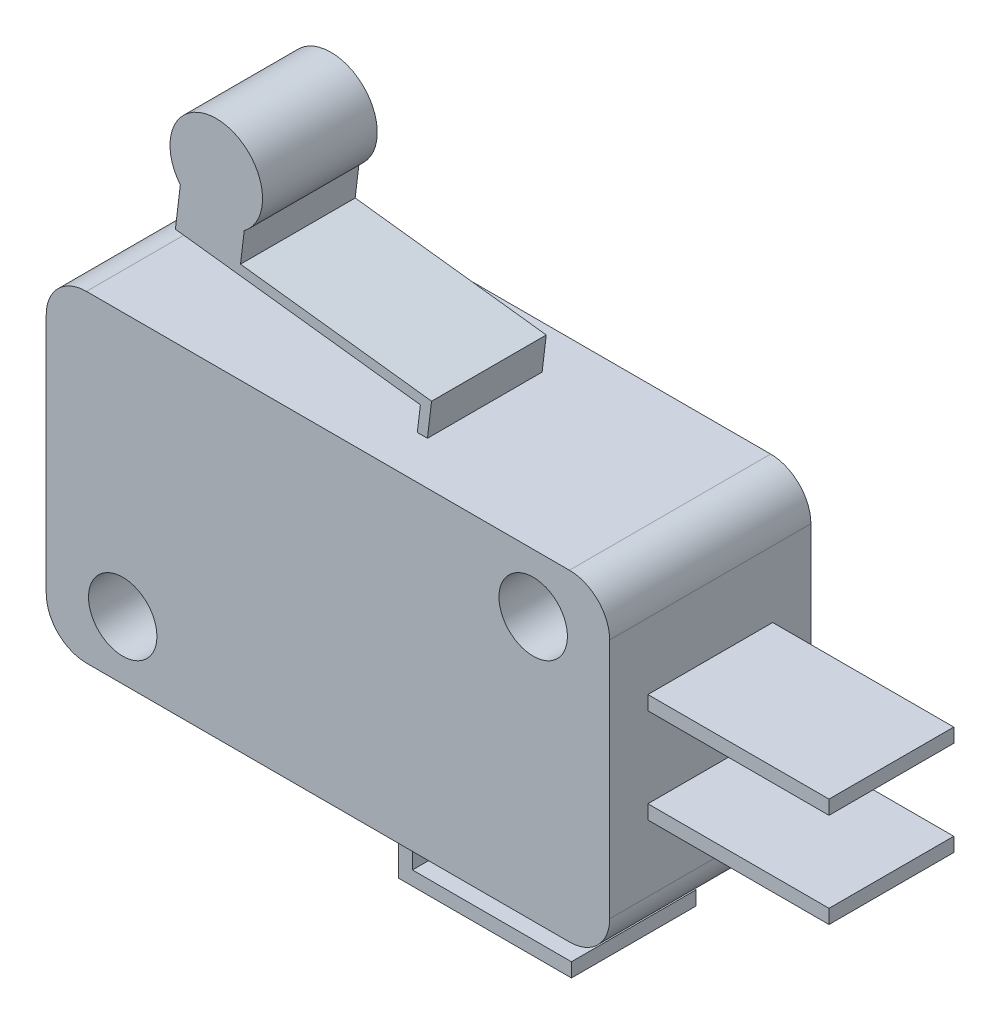
ISO-10303-21;
HEADER;
FILE_DESCRIPTION(('STEP AP214'),'2;1');
FILE_NAME('part.step','',(''),(''),'','','');
FILE_SCHEMA(('AUTOMOTIVE_DESIGN { 1 0 10303 214 1 1 1 1 }'));
ENDSEC;
DATA;
#1=APPLICATION_CONTEXT('core data for automotive mechanical design processes');
#2=APPLICATION_PROTOCOL_DEFINITION('international standard','automotive_design',2000,#1);
#3=PRODUCT_CONTEXT('',#1,'mechanical');
#4=PRODUCT('Part','Part','',(#3));
#5=PRODUCT_RELATED_PRODUCT_CATEGORY('part','',(#4));
#6=PRODUCT_DEFINITION_FORMATION('','',#4);
#7=PRODUCT_DEFINITION_CONTEXT('part definition',#1,'design');
#8=PRODUCT_DEFINITION('design','',#6,#7);
#9=PRODUCT_DEFINITION_SHAPE('','',#8);
#10=(LENGTH_UNIT() NAMED_UNIT(*) SI_UNIT(.MILLI.,.METRE.));
#11=(NAMED_UNIT(*) PLANE_ANGLE_UNIT() SI_UNIT($,.RADIAN.));
#12=(NAMED_UNIT(*) SI_UNIT($,.STERADIAN.) SOLID_ANGLE_UNIT());
#13=UNCERTAINTY_MEASURE_WITH_UNIT(LENGTH_MEASURE(1.E-05),#10,'distance_accuracy_value','');
#14=(GEOMETRIC_REPRESENTATION_CONTEXT(3) GLOBAL_UNCERTAINTY_ASSIGNED_CONTEXT((#13)) GLOBAL_UNIT_ASSIGNED_CONTEXT((#10,
#11,#12)) REPRESENTATION_CONTEXT('',''));
#15=CARTESIAN_POINT('',(0.,0.,0.));
#16=DIRECTION('',(0.,0.,1.));
#17=DIRECTION('',(1.,0.,0.));
#18=AXIS2_PLACEMENT_3D('',#15,#16,#17);
#19=CARTESIAN_POINT('',(28.,2.00000000000001,5.));
#20=DIRECTION('',(-1.,0.,0.));
#21=DIRECTION('',(0.,0.,1.));
#22=AXIS2_PLACEMENT_3D('',#19,#20,#21);
#23=PLANE('',#22);
#24=DIRECTION('',(0.,0.,-1.));
#25=VECTOR('',#24,1.);
#26=CARTESIAN_POINT('',(28.,5.3,3.1));
#27=LINE('',#26,#25);
#28=CARTESIAN_POINT('',(28.,5.3,3.1));
#29=VERTEX_POINT('',#28);
#30=CARTESIAN_POINT('',(28.,5.3,-3.1));
#31=VERTEX_POINT('',#30);
#32=EDGE_CURVE('E304',#29,#31,#27,.T.);
#33=ORIENTED_EDGE('',*,*,#32,.F.);
#34=DIRECTION('',(0.,-1.,0.));
#35=VECTOR('',#34,1.);
#36=CARTESIAN_POINT('',(28.,6.,3.1));
#37=LINE('',#36,#35);
#38=CARTESIAN_POINT('',(28.,6.,3.1));
#39=VERTEX_POINT('',#38);
#40=EDGE_CURVE('E283',#39,#29,#37,.T.);
#41=ORIENTED_EDGE('',*,*,#40,.F.);
#42=DIRECTION('',(0.,0.,-1.));
#43=VECTOR('',#42,1.);
#44=CARTESIAN_POINT('',(28.,6.,3.1));
#45=LINE('',#44,#43);
#46=CARTESIAN_POINT('',(28.,6.,-3.1));
#47=VERTEX_POINT('',#46);
#48=EDGE_CURVE('E307',#39,#47,#45,.T.);
#49=ORIENTED_EDGE('',*,*,#48,.T.);
#50=DIRECTION('',(0.,-1.,0.));
#51=VECTOR('',#50,1.);
#52=CARTESIAN_POINT('',(28.,6.,-3.1));
#53=LINE('',#52,#51);
#54=EDGE_CURVE('E294',#47,#31,#53,.T.);
#55=ORIENTED_EDGE('',*,*,#54,.T.);
#56=EDGE_LOOP('',(#33,#41,#49,#55));
#57=FACE_BOUND('',#56,.T.);
#58=DIRECTION('',(0.,1.,0.));
#59=VECTOR('',#58,1.);
#60=CARTESIAN_POINT('',(28.,2.00000000000001,-5.));
#61=LINE('',#60,#59);
#62=CARTESIAN_POINT('',(28.,2.00000000000001,-5.));
#63=VERTEX_POINT('',#62);
#64=CARTESIAN_POINT('',(28.,14.,-5.));
#65=VERTEX_POINT('',#64);
#66=EDGE_CURVE('E424',#63,#65,#61,.T.);
#67=ORIENTED_EDGE('',*,*,#66,.T.);
#68=DIRECTION('',(0.,0.,-1.));
#69=VECTOR('',#68,1.);
#70=CARTESIAN_POINT('',(28.,14.,5.));
#71=LINE('',#70,#69);
#72=CARTESIAN_POINT('',(28.,14.,5.));
#73=VERTEX_POINT('',#72);
#74=EDGE_CURVE('E454',#73,#65,#71,.T.);
#75=ORIENTED_EDGE('',*,*,#74,.F.);
#76=DIRECTION('',(0.,1.,0.));
#77=VECTOR('',#76,1.);
#78=CARTESIAN_POINT('',(28.,2.00000000000001,5.));
#79=LINE('',#78,#77);
#80=CARTESIAN_POINT('',(28.,2.00000000000001,5.));
#81=VERTEX_POINT('',#80);
#82=EDGE_CURVE('E406',#81,#73,#79,.T.);
#83=ORIENTED_EDGE('',*,*,#82,.F.);
#84=DIRECTION('',(0.,0.,-1.));
#85=VECTOR('',#84,1.);
#86=CARTESIAN_POINT('',(28.,2.00000000000001,5.));
#87=LINE('',#86,#85);
#88=EDGE_CURVE('E457',#81,#63,#87,.T.);
#89=ORIENTED_EDGE('',*,*,#88,.T.);
#90=EDGE_LOOP('',(#67,#75,#83,#89));
#91=FACE_BOUND('',#90,.T.);
#92=DIRECTION('',(0.,-1.,0.));
#93=VECTOR('',#92,1.);
#94=CARTESIAN_POINT('',(28.,10.,3.1));
#95=LINE('',#94,#93);
#96=CARTESIAN_POINT('',(28.,10.7,3.1));
#97=VERTEX_POINT('',#96);
#98=CARTESIAN_POINT('',(28.,10.,3.1));
#99=VERTEX_POINT('',#98);
#100=EDGE_CURVE('E310',#97,#99,#95,.T.);
#101=ORIENTED_EDGE('',*,*,#100,.F.);
#102=DIRECTION('',(0.,0.,-1.));
#103=VECTOR('',#102,1.);
#104=CARTESIAN_POINT('',(28.,10.7,3.1));
#105=LINE('',#104,#103);
#106=CARTESIAN_POINT('',(28.,10.7,-3.1));
#107=VERTEX_POINT('',#106);
#108=EDGE_CURVE('E320',#97,#107,#105,.T.);
#109=ORIENTED_EDGE('',*,*,#108,.T.);
#110=DIRECTION('',(0.,-1.,0.));
#111=VECTOR('',#110,1.);
#112=CARTESIAN_POINT('',(28.,10.,-3.1));
#113=LINE('',#112,#111);
#114=CARTESIAN_POINT('',(28.,10.,-3.1));
#115=VERTEX_POINT('',#114);
#116=EDGE_CURVE('E309',#107,#115,#113,.T.);
#117=ORIENTED_EDGE('',*,*,#116,.T.);
#118=DIRECTION('',(0.,0.,-1.));
#119=VECTOR('',#118,1.);
#120=CARTESIAN_POINT('',(28.,10.,3.1));
#121=LINE('',#120,#119);
#122=EDGE_CURVE('E336',#99,#115,#121,.T.);
#123=ORIENTED_EDGE('',*,*,#122,.F.);
#124=EDGE_LOOP('',(#101,#109,#117,#123));
#125=FACE_BOUND('',#124,.T.);
#126=ADVANCED_FACE('F35',(#57,#91,#125),#23,.F.);
#127=CARTESIAN_POINT('',(26.,2.,5.));
#128=DIRECTION('',(0.,0.,1.));
#129=DIRECTION('',(1.,0.,0.));
#130=AXIS2_PLACEMENT_3D('',#127,#128,#129);
#131=PLANE('',#130);
#132=CARTESIAN_POINT('',(3.8,2.9,5.));
#133=DIRECTION('',(0.,0.,1.));
#134=DIRECTION('',(1.,0.,0.));
#135=AXIS2_PLACEMENT_3D('',#132,#133,#134);
#136=CIRCLE('',#135,1.7);
#137=CARTESIAN_POINT('',(5.50000000000001,2.9,5.));
#138=VERTEX_POINT('',#137);
#139=EDGE_CURVE('E397',#138,#138,#136,.T.);
#140=ORIENTED_EDGE('',*,*,#139,.F.);
#141=EDGE_LOOP('',(#140));
#142=FACE_BOUND('',#141,.T.);
#143=CARTESIAN_POINT('',(26.,2.,5.));
#144=DIRECTION('',(0.,0.,1.));
#145=DIRECTION('',(1.,0.,0.));
#146=AXIS2_PLACEMENT_3D('',#143,#144,#145);
#147=CIRCLE('',#146,2.);
#148=CARTESIAN_POINT('',(26.,0.,5.));
#149=VERTEX_POINT('',#148);
#150=EDGE_CURVE('E403',#149,#81,#147,.T.);
#151=ORIENTED_EDGE('',*,*,#150,.T.);
#152=ORIENTED_EDGE('',*,*,#82,.T.);
#153=CARTESIAN_POINT('',(26.,14.,5.));
#154=DIRECTION('',(0.,0.,1.));
#155=DIRECTION('',(-1.,0.,0.));
#156=AXIS2_PLACEMENT_3D('',#153,#154,#155);
#157=CIRCLE('',#156,2.);
#158=CARTESIAN_POINT('',(26.,16.,5.));
#159=VERTEX_POINT('',#158);
#160=EDGE_CURVE('E409',#73,#159,#157,.T.);
#161=ORIENTED_EDGE('',*,*,#160,.T.);
#162=DIRECTION('',(-1.,0.,0.));
#163=VECTOR('',#162,1.);
#164=CARTESIAN_POINT('',(2.00000000000001,16.,5.));
#165=LINE('',#164,#163);
#166=CARTESIAN_POINT('',(2.00000000000001,16.,5.));
#167=VERTEX_POINT('',#166);
#168=EDGE_CURVE('E411',#159,#167,#165,.T.);
#169=ORIENTED_EDGE('',*,*,#168,.T.);
#170=CARTESIAN_POINT('',(2.,14.,5.));
#171=DIRECTION('',(0.,0.,1.));
#172=DIRECTION('',(-1.,0.,0.));
#173=AXIS2_PLACEMENT_3D('',#170,#171,#172);
#174=CIRCLE('',#173,2.);
#175=CARTESIAN_POINT('',(0.,14.,5.));
#176=VERTEX_POINT('',#175);
#177=EDGE_CURVE('E413',#167,#176,#174,.T.);
#178=ORIENTED_EDGE('',*,*,#177,.T.);
#179=DIRECTION('',(0.,-1.,0.));
#180=VECTOR('',#179,1.);
#181=CARTESIAN_POINT('',(0.,2.00000000000001,5.));
#182=LINE('',#181,#180);
#183=CARTESIAN_POINT('',(0.,2.00000000000001,5.));
#184=VERTEX_POINT('',#183);
#185=EDGE_CURVE('E415',#176,#184,#182,.T.);
#186=ORIENTED_EDGE('',*,*,#185,.T.);
#187=CARTESIAN_POINT('',(2.,2.,5.));
#188=DIRECTION('',(0.,0.,1.));
#189=DIRECTION('',(-1.,0.,0.));
#190=AXIS2_PLACEMENT_3D('',#187,#188,#189);
#191=CIRCLE('',#190,2.);
#192=CARTESIAN_POINT('',(2.00000000000001,0.,5.));
#193=VERTEX_POINT('',#192);
#194=EDGE_CURVE('E417',#184,#193,#191,.T.);
#195=ORIENTED_EDGE('',*,*,#194,.T.);
#196=DIRECTION('',(1.,0.,0.));
#197=VECTOR('',#196,1.);
#198=CARTESIAN_POINT('',(2.00000000000001,0.,5.));
#199=LINE('',#198,#197);
#200=EDGE_CURVE('E419',#193,#149,#199,.T.);
#201=ORIENTED_EDGE('',*,*,#200,.T.);
#202=EDGE_LOOP('',(#151,#152,#161,#169,#178,#186,#195,#201));
#203=FACE_BOUND('',#202,.T.);
#204=CARTESIAN_POINT('',(24.2,13.1,5.));
#205=DIRECTION('',(0.,0.,1.));
#206=DIRECTION('',(-1.,0.,0.));
#207=AXIS2_PLACEMENT_3D('',#204,#205,#206);
#208=CIRCLE('',#207,1.7);
#209=CARTESIAN_POINT('',(22.5,13.1,5.));
#210=VERTEX_POINT('',#209);
#211=EDGE_CURVE('E391',#210,#210,#208,.T.);
#212=ORIENTED_EDGE('',*,*,#211,.F.);
#213=EDGE_LOOP('',(#212));
#214=FACE_BOUND('',#213,.T.);
#215=ADVANCED_FACE('F514',(#142,#203,#214),#131,.T.);
#216=CARTESIAN_POINT('',(26.,2.,-5.));
#217=DIRECTION('',(0.,0.,1.));
#218=DIRECTION('',(1.,0.,0.));
#219=AXIS2_PLACEMENT_3D('',#216,#217,#218);
#220=PLANE('',#219);
#221=CARTESIAN_POINT('',(3.8,2.9,-5.));
#222=DIRECTION('',(0.,0.,1.));
#223=DIRECTION('',(1.,0.,0.));
#224=AXIS2_PLACEMENT_3D('',#221,#222,#223);
#225=CIRCLE('',#224,1.7);
#226=CARTESIAN_POINT('',(5.50000000000001,2.9,-5.));
#227=VERTEX_POINT('',#226);
#228=EDGE_CURVE('E394',#227,#227,#225,.T.);
#229=ORIENTED_EDGE('',*,*,#228,.T.);
#230=EDGE_LOOP('',(#229));
#231=FACE_BOUND('',#230,.T.);
#232=CARTESIAN_POINT('',(26.,2.,-5.));
#233=DIRECTION('',(0.,0.,1.));
#234=DIRECTION('',(1.,0.,0.));
#235=AXIS2_PLACEMENT_3D('',#232,#233,#234);
#236=CIRCLE('',#235,2.);
#237=CARTESIAN_POINT('',(26.,0.,-5.));
#238=VERTEX_POINT('',#237);
#239=EDGE_CURVE('E400',#238,#63,#236,.T.);
#240=ORIENTED_EDGE('',*,*,#239,.F.);
#241=DIRECTION('',(1.,0.,0.));
#242=VECTOR('',#241,1.);
#243=CARTESIAN_POINT('',(2.00000000000001,0.,-5.));
#244=LINE('',#243,#242);
#245=CARTESIAN_POINT('',(2.00000000000001,0.,-5.));
#246=VERTEX_POINT('',#245);
#247=EDGE_CURVE('E407',#246,#238,#244,.T.);
#248=ORIENTED_EDGE('',*,*,#247,.F.);
#249=CARTESIAN_POINT('',(2.,2.,-5.));
#250=DIRECTION('',(0.,0.,1.));
#251=DIRECTION('',(-1.,0.,0.));
#252=AXIS2_PLACEMENT_3D('',#249,#250,#251);
#253=CIRCLE('',#252,2.);
#254=CARTESIAN_POINT('',(0.,2.00000000000001,-5.));
#255=VERTEX_POINT('',#254);
#256=EDGE_CURVE('E434',#255,#246,#253,.T.);
#257=ORIENTED_EDGE('',*,*,#256,.F.);
#258=DIRECTION('',(0.,-1.,0.));
#259=VECTOR('',#258,1.);
#260=CARTESIAN_POINT('',(0.,2.00000000000001,-5.));
#261=LINE('',#260,#259);
#262=CARTESIAN_POINT('',(0.,14.,-5.));
#263=VERTEX_POINT('',#262);
#264=EDGE_CURVE('E432',#263,#255,#261,.T.);
#265=ORIENTED_EDGE('',*,*,#264,.F.);
#266=CARTESIAN_POINT('',(2.,14.,-5.));
#267=DIRECTION('',(0.,0.,1.));
#268=DIRECTION('',(-1.,0.,0.));
#269=AXIS2_PLACEMENT_3D('',#266,#267,#268);
#270=CIRCLE('',#269,2.);
#271=CARTESIAN_POINT('',(2.00000000000001,16.,-5.));
#272=VERTEX_POINT('',#271);
#273=EDGE_CURVE('E430',#272,#263,#270,.T.);
#274=ORIENTED_EDGE('',*,*,#273,.F.);
#275=DIRECTION('',(-1.,0.,0.));
#276=VECTOR('',#275,1.);
#277=CARTESIAN_POINT('',(2.00000000000001,16.,-5.));
#278=LINE('',#277,#276);
#279=CARTESIAN_POINT('',(26.,16.,-5.));
#280=VERTEX_POINT('',#279);
#281=EDGE_CURVE('E428',#280,#272,#278,.T.);
#282=ORIENTED_EDGE('',*,*,#281,.F.);
#283=CARTESIAN_POINT('',(26.,14.,-5.));
#284=DIRECTION('',(0.,0.,1.));
#285=DIRECTION('',(-1.,0.,0.));
#286=AXIS2_PLACEMENT_3D('',#283,#284,#285);
#287=CIRCLE('',#286,2.);
#288=EDGE_CURVE('E426',#65,#280,#287,.T.);
#289=ORIENTED_EDGE('',*,*,#288,.F.);
#290=ORIENTED_EDGE('',*,*,#66,.F.);
#291=EDGE_LOOP('',(#240,#248,#257,#265,#274,#282,#289,#290));
#292=FACE_BOUND('',#291,.T.);
#293=CARTESIAN_POINT('',(24.2,13.1,-5.));
#294=DIRECTION('',(0.,0.,1.));
#295=DIRECTION('',(-1.,0.,0.));
#296=AXIS2_PLACEMENT_3D('',#293,#294,#295);
#297=CIRCLE('',#296,1.7);
#298=CARTESIAN_POINT('',(22.5,13.1,-5.));
#299=VERTEX_POINT('',#298);
#300=EDGE_CURVE('E390',#299,#299,#297,.T.);
#301=ORIENTED_EDGE('',*,*,#300,.T.);
#302=EDGE_LOOP('',(#301));
#303=FACE_BOUND('',#302,.T.);
#304=ADVANCED_FACE('F519',(#231,#292,#303),#220,.F.);
#305=CARTESIAN_POINT('',(26.,2.,5.));
#306=DIRECTION('',(0.,0.,-1.));
#307=DIRECTION('',(-1.,0.,0.));
#308=AXIS2_PLACEMENT_3D('',#305,#306,#307);
#309=CYLINDRICAL_SURFACE('',#308,2.);
#310=ORIENTED_EDGE('',*,*,#239,.T.);
#311=ORIENTED_EDGE('',*,*,#88,.F.);
#312=ORIENTED_EDGE('',*,*,#150,.F.);
#313=DIRECTION('',(0.,0.,-1.));
#314=VECTOR('',#313,1.);
#315=CARTESIAN_POINT('',(26.,0.,5.));
#316=LINE('',#315,#314);
#317=EDGE_CURVE('E421',#149,#238,#316,.T.);
#318=ORIENTED_EDGE('',*,*,#317,.T.);
#319=EDGE_LOOP('',(#310,#311,#312,#318));
#320=FACE_BOUND('',#319,.T.);
#321=ADVANCED_FACE('F37',(#320),#309,.T.);
#322=CARTESIAN_POINT('',(26.,14.,5.));
#323=DIRECTION('',(0.,0.,-1.));
#324=DIRECTION('',(-1.,0.,0.));
#325=AXIS2_PLACEMENT_3D('',#322,#323,#324);
#326=CYLINDRICAL_SURFACE('',#325,2.);
#327=ORIENTED_EDGE('',*,*,#288,.T.);
#328=DIRECTION('',(0.,0.,-1.));
#329=VECTOR('',#328,1.);
#330=CARTESIAN_POINT('',(26.,16.,5.));
#331=LINE('',#330,#329);
#332=EDGE_CURVE('E451',#159,#280,#331,.T.);
#333=ORIENTED_EDGE('',*,*,#332,.F.);
#334=ORIENTED_EDGE('',*,*,#160,.F.);
#335=ORIENTED_EDGE('',*,*,#74,.T.);
#336=EDGE_LOOP('',(#327,#333,#334,#335));
#337=FACE_BOUND('',#336,.T.);
#338=ADVANCED_FACE('F524',(#337),#326,.T.);
#339=CARTESIAN_POINT('',(2.00000000000001,16.,5.));
#340=DIRECTION('',(0.,-1.,0.));
#341=DIRECTION('',(0.,0.,-1.));
#342=AXIS2_PLACEMENT_3D('',#339,#340,#341);
#343=PLANE('',#342);
#344=DIRECTION('',(0.,0.,1.));
#345=VECTOR('',#344,1.);
#346=CARTESIAN_POINT('',(16.7945179215741,16.,5.));
#347=LINE('',#346,#345);
#348=CARTESIAN_POINT('',(16.7945179215741,16.,-2.85));
#349=VERTEX_POINT('',#348);
#350=CARTESIAN_POINT('',(16.7945179215741,16.,2.85));
#351=VERTEX_POINT('',#350);
#352=EDGE_CURVE('E463',#349,#351,#347,.T.);
#353=ORIENTED_EDGE('',*,*,#352,.T.);
#354=DIRECTION('',(-1.,0.,0.));
#355=VECTOR('',#354,1.);
#356=CARTESIAN_POINT('',(2.00000000000001,16.,2.85));
#357=LINE('',#356,#355);
#358=CARTESIAN_POINT('',(16.2908786670835,16.,2.85));
#359=VERTEX_POINT('',#358);
#360=EDGE_CURVE('E11',#351,#359,#357,.T.);
#361=ORIENTED_EDGE('',*,*,#360,.T.);
#362=DIRECTION('',(0.,0.,-1.));
#363=VECTOR('',#362,1.);
#364=CARTESIAN_POINT('',(16.2908786670835,16.,5.));
#365=LINE('',#364,#363);
#366=CARTESIAN_POINT('',(16.2908786670835,16.,-2.85));
#367=VERTEX_POINT('',#366);
#368=EDGE_CURVE('E43',#359,#367,#365,.T.);
#369=ORIENTED_EDGE('',*,*,#368,.T.);
#370=DIRECTION('',(-1.,0.,0.));
#371=VECTOR('',#370,1.);
#372=CARTESIAN_POINT('',(2.00000000000001,16.,-2.85));
#373=LINE('',#372,#371);
#374=EDGE_CURVE('E460',#349,#367,#373,.T.);
#375=ORIENTED_EDGE('',*,*,#374,.F.);
#376=EDGE_LOOP('',(#353,#361,#369,#375));
#377=FACE_BOUND('',#376,.T.);
#378=ORIENTED_EDGE('',*,*,#281,.T.);
#379=DIRECTION('',(0.,0.,-1.));
#380=VECTOR('',#379,1.);
#381=CARTESIAN_POINT('',(2.00000000000001,16.,5.));
#382=LINE('',#381,#380);
#383=EDGE_CURVE('E448',#167,#272,#382,.T.);
#384=ORIENTED_EDGE('',*,*,#383,.F.);
#385=ORIENTED_EDGE('',*,*,#168,.F.);
#386=ORIENTED_EDGE('',*,*,#332,.T.);
#387=EDGE_LOOP('',(#378,#384,#385,#386));
#388=FACE_BOUND('',#387,.T.);
#389=ADVANCED_FACE('F466',(#377,#388),#343,.F.);
#390=CARTESIAN_POINT('',(2.,14.,5.));
#391=DIRECTION('',(0.,0.,-1.));
#392=DIRECTION('',(-1.,0.,0.));
#393=AXIS2_PLACEMENT_3D('',#390,#391,#392);
#394=CYLINDRICAL_SURFACE('',#393,2.);
#395=ORIENTED_EDGE('',*,*,#273,.T.);
#396=DIRECTION('',(0.,0.,-1.));
#397=VECTOR('',#396,1.);
#398=CARTESIAN_POINT('',(0.,14.,5.));
#399=LINE('',#398,#397);
#400=EDGE_CURVE('E445',#176,#263,#399,.T.);
#401=ORIENTED_EDGE('',*,*,#400,.F.);
#402=ORIENTED_EDGE('',*,*,#177,.F.);
#403=ORIENTED_EDGE('',*,*,#383,.T.);
#404=EDGE_LOOP('',(#395,#401,#402,#403));
#405=FACE_BOUND('',#404,.T.);
#406=ADVANCED_FACE('F530',(#405),#394,.T.);
#407=CARTESIAN_POINT('',(0.,2.00000000000001,5.));
#408=DIRECTION('',(1.,0.,0.));
#409=DIRECTION('',(0.,0.,-1.));
#410=AXIS2_PLACEMENT_3D('',#407,#408,#409);
#411=PLANE('',#410);
#412=ORIENTED_EDGE('',*,*,#264,.T.);
#413=DIRECTION('',(0.,0.,-1.));
#414=VECTOR('',#413,1.);
#415=CARTESIAN_POINT('',(0.,2.00000000000001,5.));
#416=LINE('',#415,#414);
#417=EDGE_CURVE('E442',#184,#255,#416,.T.);
#418=ORIENTED_EDGE('',*,*,#417,.F.);
#419=ORIENTED_EDGE('',*,*,#185,.F.);
#420=ORIENTED_EDGE('',*,*,#400,.T.);
#421=EDGE_LOOP('',(#412,#418,#419,#420));
#422=FACE_BOUND('',#421,.T.);
#423=ADVANCED_FACE('F533',(#422),#411,.F.);
#424=CARTESIAN_POINT('',(2.,2.,5.));
#425=DIRECTION('',(0.,0.,-1.));
#426=DIRECTION('',(-1.,0.,0.));
#427=AXIS2_PLACEMENT_3D('',#424,#425,#426);
#428=CYLINDRICAL_SURFACE('',#427,2.);
#429=ORIENTED_EDGE('',*,*,#256,.T.);
#430=DIRECTION('',(0.,0.,-1.));
#431=VECTOR('',#430,1.);
#432=CARTESIAN_POINT('',(2.00000000000001,0.,5.));
#433=LINE('',#432,#431);
#434=EDGE_CURVE('E439',#193,#246,#433,.T.);
#435=ORIENTED_EDGE('',*,*,#434,.F.);
#436=ORIENTED_EDGE('',*,*,#194,.F.);
#437=ORIENTED_EDGE('',*,*,#417,.T.);
#438=EDGE_LOOP('',(#429,#435,#436,#437));
#439=FACE_BOUND('',#438,.T.);
#440=ADVANCED_FACE('F537',(#439),#428,.T.);
#441=CARTESIAN_POINT('',(2.00000000000001,0.,5.));
#442=DIRECTION('',(0.,1.,0.));
#443=DIRECTION('',(0.,0.,1.));
#444=AXIS2_PLACEMENT_3D('',#441,#442,#443);
#445=PLANE('',#444);
#446=DIRECTION('',(0.,0.,-1.));
#447=VECTOR('',#446,1.);
#448=CARTESIAN_POINT('',(15.6,0.,3.1));
#449=LINE('',#448,#447);
#450=CARTESIAN_POINT('',(15.6,0.,3.1));
#451=VERTEX_POINT('',#450);
#452=CARTESIAN_POINT('',(15.6,0.,-3.1));
#453=VERTEX_POINT('',#452);
#454=EDGE_CURVE('E50',#451,#453,#449,.T.);
#455=ORIENTED_EDGE('',*,*,#454,.F.);
#456=DIRECTION('',(-1.,0.,0.));
#457=VECTOR('',#456,1.);
#458=CARTESIAN_POINT('',(15.6,0.,3.1));
#459=LINE('',#458,#457);
#460=CARTESIAN_POINT('',(16.3,0.,3.1));
#461=VERTEX_POINT('',#460);
#462=EDGE_CURVE('E55',#461,#451,#459,.T.);
#463=ORIENTED_EDGE('',*,*,#462,.F.);
#464=DIRECTION('',(0.,0.,-1.));
#465=VECTOR('',#464,1.);
#466=CARTESIAN_POINT('',(16.3,0.,3.1));
#467=LINE('',#466,#465);
#468=CARTESIAN_POINT('',(16.3,0.,-3.1));
#469=VERTEX_POINT('',#468);
#470=EDGE_CURVE('E257',#461,#469,#467,.T.);
#471=ORIENTED_EDGE('',*,*,#470,.T.);
#472=DIRECTION('',(-1.,0.,0.));
#473=VECTOR('',#472,1.);
#474=CARTESIAN_POINT('',(15.6,0.,-3.1));
#475=LINE('',#474,#473);
#476=EDGE_CURVE('E258',#469,#453,#475,.T.);
#477=ORIENTED_EDGE('',*,*,#476,.T.);
#478=EDGE_LOOP('',(#455,#463,#471,#477));
#479=FACE_BOUND('',#478,.T.);
#480=ORIENTED_EDGE('',*,*,#247,.T.);
#481=ORIENTED_EDGE('',*,*,#317,.F.);
#482=ORIENTED_EDGE('',*,*,#200,.F.);
#483=ORIENTED_EDGE('',*,*,#434,.T.);
#484=EDGE_LOOP('',(#480,#481,#482,#483));
#485=FACE_BOUND('',#484,.T.);
#486=ADVANCED_FACE('F541',(#479,#485),#445,.F.);
#487=CARTESIAN_POINT('',(3.8,2.9,5.));
#488=DIRECTION('',(0.,0.,-1.));
#489=DIRECTION('',(-1.,0.,0.));
#490=AXIS2_PLACEMENT_3D('',#487,#488,#489);
#491=CYLINDRICAL_SURFACE('',#490,1.7);
#492=ORIENTED_EDGE('',*,*,#139,.T.);
#493=EDGE_LOOP('',(#492));
#494=FACE_BOUND('',#493,.T.);
#495=ORIENTED_EDGE('',*,*,#228,.F.);
#496=EDGE_LOOP('',(#495));
#497=FACE_BOUND('',#496,.T.);
#498=ADVANCED_FACE('F545',(#494,#497),#491,.F.);
#499=CARTESIAN_POINT('',(24.2,13.1,5.));
#500=DIRECTION('',(0.,0.,-1.));
#501=DIRECTION('',(-1.,0.,0.));
#502=AXIS2_PLACEMENT_3D('',#499,#500,#501);
#503=CYLINDRICAL_SURFACE('',#502,1.7);
#504=ORIENTED_EDGE('',*,*,#211,.T.);
#505=EDGE_LOOP('',(#504));
#506=FACE_BOUND('',#505,.T.);
#507=ORIENTED_EDGE('',*,*,#300,.F.);
#508=EDGE_LOOP('',(#507));
#509=FACE_BOUND('',#508,.T.);
#510=ADVANCED_FACE('F551',(#506,#509),#503,.F.);
#511=CARTESIAN_POINT('',(14.1501954142872,-1.71035974344718,2.85));
#512=DIRECTION('',(-0.992774084906679,0.119998401396461,0.));
#513=DIRECTION('',(-0.119998401396461,-0.992774084906679,0.));
#514=AXIS2_PLACEMENT_3D('',#511,#512,#513);
#515=PLANE('',#514);
#516=ORIENTED_EDGE('',*,*,#368,.F.);
#517=DIRECTION('',(0.119998401396461,0.992774084906679,0.));
#518=VECTOR('',#517,1.);
#519=CARTESIAN_POINT('',(14.1501954142872,-1.71035974344718,2.85));
#520=LINE('',#519,#518);
#521=CARTESIAN_POINT('',(16.4436137568484,17.2636121582449,2.85));
#522=VERTEX_POINT('',#521);
#523=EDGE_CURVE('E351',#359,#522,#520,.T.);
#524=ORIENTED_EDGE('',*,*,#523,.T.);
#525=DIRECTION('',(0.,0.,-1.));
#526=VECTOR('',#525,1.);
#527=CARTESIAN_POINT('',(16.4436137568484,17.2636121582449,2.85));
#528=LINE('',#527,#526);
#529=CARTESIAN_POINT('',(16.4436137568484,17.2636121582449,-2.85));
#530=VERTEX_POINT('',#529);
#531=EDGE_CURVE('E381',#522,#530,#528,.T.);
#532=ORIENTED_EDGE('',*,*,#531,.T.);
#533=DIRECTION('',(0.119998401396461,0.992774084906679,0.));
#534=VECTOR('',#533,1.);
#535=CARTESIAN_POINT('',(14.1501954142872,-1.71035974344718,-2.85));
#536=LINE('',#535,#534);
#537=EDGE_CURVE('E371',#367,#530,#536,.T.);
#538=ORIENTED_EDGE('',*,*,#537,.F.);
#539=EDGE_LOOP('',(#516,#524,#532,#538));
#540=FACE_BOUND('',#539,.T.);
#541=ADVANCED_FACE('F476',(#540),#515,.T.);
#542=CARTESIAN_POINT('',(14.6465824567405,-1.77035894414541,2.85));
#543=DIRECTION('',(0.992774084906679,-0.119998401396461,0.));
#544=DIRECTION('',(0.119998401396461,0.992774084906679,0.));
#545=AXIS2_PLACEMENT_3D('',#542,#543,#544);
#546=PLANE('',#545);
#547=ORIENTED_EDGE('',*,*,#352,.F.);
#548=DIRECTION('',(-0.119998401396461,-0.992774084906679,0.));
#549=VECTOR('',#548,1.);
#550=CARTESIAN_POINT('',(14.6465824567405,-1.77035894414541,-2.85));
#551=LINE('',#550,#549);
#552=CARTESIAN_POINT('',(17.,17.7,-2.85));
#553=VERTEX_POINT('',#552);
#554=EDGE_CURVE('E373',#553,#349,#551,.T.);
#555=ORIENTED_EDGE('',*,*,#554,.F.);
#556=DIRECTION('',(0.,0.,-1.));
#557=VECTOR('',#556,1.);
#558=CARTESIAN_POINT('',(17.,17.7,2.85));
#559=LINE('',#558,#557);
#560=CARTESIAN_POINT('',(17.,17.7,2.85));
#561=VERTEX_POINT('',#560);
#562=EDGE_CURVE('E379',#561,#553,#559,.T.);
#563=ORIENTED_EDGE('',*,*,#562,.F.);
#564=DIRECTION('',(-0.119998401396461,-0.992774084906679,0.));
#565=VECTOR('',#564,1.);
#566=CARTESIAN_POINT('',(14.6465824567405,-1.77035894414541,2.85));
#567=LINE('',#566,#565);
#568=EDGE_CURVE('E353',#561,#351,#567,.T.);
#569=ORIENTED_EDGE('',*,*,#568,.T.);
#570=EDGE_LOOP('',(#547,#555,#563,#569));
#571=FACE_BOUND('',#570,.T.);
#572=ADVANCED_FACE('F501',(#571),#546,.T.);
#573=CARTESIAN_POINT('',(0.,0.,2.85));
#574=DIRECTION('',(0.,0.,1.));
#575=DIRECTION('',(1.,0.,0.));
#576=AXIS2_PLACEMENT_3D('',#573,#574,#575);
#577=PLANE('',#576);
#578=ORIENTED_EDGE('',*,*,#360,.F.);
#579=ORIENTED_EDGE('',*,*,#568,.F.);
#580=DIRECTION('',(0.992774084906679,-0.119998401396462,0.));
#581=VECTOR('',#580,1.);
#582=CARTESIAN_POINT('',(2.35341754325948,19.4703589441454,2.85));
#583=LINE('',#582,#581);
#584=CARTESIAN_POINT('',(7.50444365138201,18.8477450907789,2.85));
#585=VERTEX_POINT('',#584);
#586=EDGE_CURVE('E356',#585,#561,#583,.T.);
#587=ORIENTED_EDGE('',*,*,#586,.F.);
#588=DIRECTION('',(-0.119998401396461,-0.992774084906679,0.));
#589=VECTOR('',#588,1.);
#590=CARTESIAN_POINT('',(5.15102610812254,-0.622613853366492,2.85));
#591=LINE('',#590,#589);
#592=CARTESIAN_POINT('',(7.69016863747491,20.384290169438,2.85));
#593=VERTEX_POINT('',#592);
#594=EDGE_CURVE('E339',#593,#585,#591,.T.);
#595=ORIENTED_EDGE('',*,*,#594,.F.);
#596=CARTESIAN_POINT('',(6.29999999999999,22.2166196047146,2.85));
#597=DIRECTION('',(0.,0.,1.));
#598=DIRECTION('',(1.,0.,0.));
#599=AXIS2_PLACEMENT_3D('',#596,#597,#598);
#600=CIRCLE('',#599,2.3);
#601=CARTESIAN_POINT('',(4.51329156577354,20.7682850539067,2.85));
#602=VERTEX_POINT('',#601);
#603=EDGE_CURVE('E342',#593,#602,#600,.T.);
#604=ORIENTED_EDGE('',*,*,#603,.T.);
#605=DIRECTION('',(0.119998401396462,0.992774084906679,0.));
#606=VECTOR('',#605,1.);
#607=CARTESIAN_POINT('',(1.97414903642116,-0.238618968897815,2.85));
#608=LINE('',#607,#606);
#609=CARTESIAN_POINT('',(4.2675673789824,18.7353529327943,2.85));
#610=VERTEX_POINT('',#609);
#611=EDGE_CURVE('E345',#610,#602,#608,.T.);
#612=ORIENTED_EDGE('',*,*,#611,.F.);
#613=DIRECTION('',(-0.992774084906679,0.119998401396462,0.));
#614=VECTOR('',#613,1.);
#615=CARTESIAN_POINT('',(2.29341834256124,18.9739719016921,2.85));
#616=LINE('',#615,#614);
#617=EDGE_CURVE('E348',#522,#610,#616,.T.);
#618=ORIENTED_EDGE('',*,*,#617,.F.);
#619=ORIENTED_EDGE('',*,*,#523,.F.);
#620=EDGE_LOOP('',(#578,#579,#587,#595,#604,#612,#618,#619));
#621=FACE_BOUND('',#620,.T.);
#622=ADVANCED_FACE('F503',(#621),#577,.T.);
#623=CARTESIAN_POINT('',(0.,0.,-2.85));
#624=DIRECTION('',(0.,0.,1.));
#625=DIRECTION('',(1.,0.,0.));
#626=AXIS2_PLACEMENT_3D('',#623,#624,#625);
#627=PLANE('',#626);
#628=ORIENTED_EDGE('',*,*,#554,.T.);
#629=ORIENTED_EDGE('',*,*,#374,.T.);
#630=ORIENTED_EDGE('',*,*,#537,.T.);
#631=DIRECTION('',(-0.992774084906679,0.119998401396462,0.));
#632=VECTOR('',#631,1.);
#633=CARTESIAN_POINT('',(2.29341834256124,18.9739719016921,-2.85));
#634=LINE('',#633,#632);
#635=CARTESIAN_POINT('',(4.2675673789824,18.7353529327943,-2.85));
#636=VERTEX_POINT('',#635);
#637=EDGE_CURVE('E368',#530,#636,#634,.T.);
#638=ORIENTED_EDGE('',*,*,#637,.T.);
#639=DIRECTION('',(0.119998401396462,0.992774084906679,0.));
#640=VECTOR('',#639,1.);
#641=CARTESIAN_POINT('',(1.97414903642116,-0.238618968897815,-2.85));
#642=LINE('',#641,#640);
#643=CARTESIAN_POINT('',(4.51329156577354,20.7682850539067,-2.85));
#644=VERTEX_POINT('',#643);
#645=EDGE_CURVE('E365',#636,#644,#642,.T.);
#646=ORIENTED_EDGE('',*,*,#645,.T.);
#647=CARTESIAN_POINT('',(6.29999999999999,22.2166196047146,-2.85));
#648=DIRECTION('',(0.,0.,1.));
#649=DIRECTION('',(1.,0.,0.));
#650=AXIS2_PLACEMENT_3D('',#647,#648,#649);
#651=CIRCLE('',#650,2.3);
#652=CARTESIAN_POINT('',(7.69016863747491,20.384290169438,-2.85));
#653=VERTEX_POINT('',#652);
#654=EDGE_CURVE('E362',#653,#644,#651,.T.);
#655=ORIENTED_EDGE('',*,*,#654,.F.);
#656=DIRECTION('',(-0.119998401396461,-0.992774084906679,0.));
#657=VECTOR('',#656,1.);
#658=CARTESIAN_POINT('',(5.15102610812254,-0.622613853366492,-2.85));
#659=LINE('',#658,#657);
#660=CARTESIAN_POINT('',(7.50444365138201,18.8477450907789,-2.85));
#661=VERTEX_POINT('',#660);
#662=EDGE_CURVE('E338',#653,#661,#659,.T.);
#663=ORIENTED_EDGE('',*,*,#662,.T.);
#664=DIRECTION('',(0.992774084906679,-0.119998401396462,0.));
#665=VECTOR('',#664,1.);
#666=CARTESIAN_POINT('',(2.35341754325948,19.4703589441454,-2.85));
#667=LINE('',#666,#665);
#668=EDGE_CURVE('E343',#661,#553,#667,.T.);
#669=ORIENTED_EDGE('',*,*,#668,.T.);
#670=EDGE_LOOP('',(#628,#629,#630,#638,#646,#655,#663,#669));
#671=FACE_BOUND('',#670,.T.);
#672=ADVANCED_FACE('F474',(#671),#627,.F.);
#673=CARTESIAN_POINT('',(5.15102610812254,-0.622613853366492,2.85));
#674=DIRECTION('',(0.992774084906679,-0.119998401396461,0.));
#675=DIRECTION('',(0.119998401396461,0.992774084906679,0.));
#676=AXIS2_PLACEMENT_3D('',#673,#674,#675);
#677=PLANE('',#676);
#678=ORIENTED_EDGE('',*,*,#662,.F.);
#679=DIRECTION('',(0.,0.,-1.));
#680=VECTOR('',#679,1.);
#681=CARTESIAN_POINT('',(7.69016863747491,20.384290169438,2.85));
#682=LINE('',#681,#680);
#683=EDGE_CURVE('E388',#593,#653,#682,.T.);
#684=ORIENTED_EDGE('',*,*,#683,.F.);
#685=ORIENTED_EDGE('',*,*,#594,.T.);
#686=DIRECTION('',(0.,0.,-1.));
#687=VECTOR('',#686,1.);
#688=CARTESIAN_POINT('',(7.50444365138201,18.8477450907789,2.85));
#689=LINE('',#688,#687);
#690=EDGE_CURVE('E359',#585,#661,#689,.T.);
#691=ORIENTED_EDGE('',*,*,#690,.T.);
#692=EDGE_LOOP('',(#678,#684,#685,#691));
#693=FACE_BOUND('',#692,.T.);
#694=ADVANCED_FACE('F494',(#693),#677,.T.);
#695=CARTESIAN_POINT('',(6.29999999999999,22.2166196047146,2.85));
#696=DIRECTION('',(0.,0.,-1.));
#697=DIRECTION('',(-1.,0.,0.));
#698=AXIS2_PLACEMENT_3D('',#695,#696,#697);
#699=CYLINDRICAL_SURFACE('',#698,2.3);
#700=ORIENTED_EDGE('',*,*,#654,.T.);
#701=DIRECTION('',(0.,0.,-1.));
#702=VECTOR('',#701,1.);
#703=CARTESIAN_POINT('',(4.51329156577354,20.7682850539067,2.85));
#704=LINE('',#703,#702);
#705=EDGE_CURVE('E386',#602,#644,#704,.T.);
#706=ORIENTED_EDGE('',*,*,#705,.F.);
#707=ORIENTED_EDGE('',*,*,#603,.F.);
#708=ORIENTED_EDGE('',*,*,#683,.T.);
#709=EDGE_LOOP('',(#700,#706,#707,#708));
#710=FACE_BOUND('',#709,.T.);
#711=ADVANCED_FACE('F491',(#710),#699,.T.);
#712=CARTESIAN_POINT('',(1.97414903642116,-0.238618968897815,2.85));
#713=DIRECTION('',(-0.992774084906679,0.119998401396462,0.));
#714=DIRECTION('',(-0.119998401396462,-0.992774084906679,0.));
#715=AXIS2_PLACEMENT_3D('',#712,#713,#714);
#716=PLANE('',#715);
#717=ORIENTED_EDGE('',*,*,#645,.F.);
#718=DIRECTION('',(0.,0.,-1.));
#719=VECTOR('',#718,1.);
#720=CARTESIAN_POINT('',(4.2675673789824,18.7353529327943,2.85));
#721=LINE('',#720,#719);
#722=EDGE_CURVE('E384',#610,#636,#721,.T.);
#723=ORIENTED_EDGE('',*,*,#722,.F.);
#724=ORIENTED_EDGE('',*,*,#611,.T.);
#725=ORIENTED_EDGE('',*,*,#705,.T.);
#726=EDGE_LOOP('',(#717,#723,#724,#725));
#727=FACE_BOUND('',#726,.T.);
#728=ADVANCED_FACE('F486',(#727),#716,.T.);
#729=CARTESIAN_POINT('',(2.29341834256124,18.9739719016921,2.85));
#730=DIRECTION('',(-0.119998401396462,-0.992774084906679,0.));
#731=DIRECTION('',(0.992774084906679,-0.119998401396462,0.));
#732=AXIS2_PLACEMENT_3D('',#729,#730,#731);
#733=PLANE('',#732);
#734=ORIENTED_EDGE('',*,*,#637,.F.);
#735=ORIENTED_EDGE('',*,*,#531,.F.);
#736=ORIENTED_EDGE('',*,*,#617,.T.);
#737=ORIENTED_EDGE('',*,*,#722,.T.);
#738=EDGE_LOOP('',(#734,#735,#736,#737));
#739=FACE_BOUND('',#738,.T.);
#740=ADVANCED_FACE('F481',(#739),#733,.T.);
#741=CARTESIAN_POINT('',(2.35341754325948,19.4703589441454,2.85));
#742=DIRECTION('',(0.119998401396462,0.992774084906679,0.));
#743=DIRECTION('',(-0.992774084906679,0.119998401396462,0.));
#744=AXIS2_PLACEMENT_3D('',#741,#742,#743);
#745=PLANE('',#744);
#746=ORIENTED_EDGE('',*,*,#668,.F.);
#747=ORIENTED_EDGE('',*,*,#690,.F.);
#748=ORIENTED_EDGE('',*,*,#586,.T.);
#749=ORIENTED_EDGE('',*,*,#562,.T.);
#750=EDGE_LOOP('',(#746,#747,#748,#749));
#751=FACE_BOUND('',#750,.T.);
#752=ADVANCED_FACE('F498',(#751),#745,.T.);
#753=CARTESIAN_POINT('',(37.,10.,3.1));
#754=DIRECTION('',(0.,1.,0.));
#755=DIRECTION('',(0.,0.,1.));
#756=AXIS2_PLACEMENT_3D('',#753,#754,#755);
#757=PLANE('',#756);
#758=DIRECTION('',(1.,0.,0.));
#759=VECTOR('',#758,1.);
#760=CARTESIAN_POINT('',(37.,10.,-3.1));
#761=LINE('',#760,#759);
#762=CARTESIAN_POINT('',(37.,10.,-3.1));
#763=VERTEX_POINT('',#762);
#764=EDGE_CURVE('E323',#115,#763,#761,.T.);
#765=ORIENTED_EDGE('',*,*,#764,.T.);
#766=DIRECTION('',(0.,0.,-1.));
#767=VECTOR('',#766,1.);
#768=CARTESIAN_POINT('',(37.,10.,3.1));
#769=LINE('',#768,#767);
#770=CARTESIAN_POINT('',(37.,10.,3.1));
#771=VERTEX_POINT('',#770);
#772=EDGE_CURVE('E333',#771,#763,#769,.T.);
#773=ORIENTED_EDGE('',*,*,#772,.F.);
#774=DIRECTION('',(1.,0.,0.));
#775=VECTOR('',#774,1.);
#776=CARTESIAN_POINT('',(37.,10.,3.1));
#777=LINE('',#776,#775);
#778=EDGE_CURVE('E313',#99,#771,#777,.T.);
#779=ORIENTED_EDGE('',*,*,#778,.F.);
#780=ORIENTED_EDGE('',*,*,#122,.T.);
#781=EDGE_LOOP('',(#765,#773,#779,#780));
#782=FACE_BOUND('',#781,.T.);
#783=ADVANCED_FACE('F567',(#782),#757,.F.);
#784=CARTESIAN_POINT('',(37.,10.7,3.1));
#785=DIRECTION('',(-1.,0.,0.));
#786=DIRECTION('',(0.,0.,1.));
#787=AXIS2_PLACEMENT_3D('',#784,#785,#786);
#788=PLANE('',#787);
#789=DIRECTION('',(0.,1.,0.));
#790=VECTOR('',#789,1.);
#791=CARTESIAN_POINT('',(37.,10.7,-3.1));
#792=LINE('',#791,#790);
#793=CARTESIAN_POINT('',(37.,10.7,-3.1));
#794=VERTEX_POINT('',#793);
#795=EDGE_CURVE('E325',#763,#794,#792,.T.);
#796=ORIENTED_EDGE('',*,*,#795,.T.);
#797=DIRECTION('',(0.,0.,-1.));
#798=VECTOR('',#797,1.);
#799=CARTESIAN_POINT('',(37.,10.7,3.1));
#800=LINE('',#799,#798);
#801=CARTESIAN_POINT('',(37.,10.7,3.1));
#802=VERTEX_POINT('',#801);
#803=EDGE_CURVE('E330',#802,#794,#800,.T.);
#804=ORIENTED_EDGE('',*,*,#803,.F.);
#805=DIRECTION('',(0.,1.,0.));
#806=VECTOR('',#805,1.);
#807=CARTESIAN_POINT('',(37.,10.7,3.1));
#808=LINE('',#807,#806);
#809=EDGE_CURVE('E316',#771,#802,#808,.T.);
#810=ORIENTED_EDGE('',*,*,#809,.F.);
#811=ORIENTED_EDGE('',*,*,#772,.T.);
#812=EDGE_LOOP('',(#796,#804,#810,#811));
#813=FACE_BOUND('',#812,.T.);
#814=ADVANCED_FACE('F571',(#813),#788,.F.);
#815=CARTESIAN_POINT('',(28.,10.7,3.1));
#816=DIRECTION('',(0.,-1.,0.));
#817=DIRECTION('',(0.,0.,-1.));
#818=AXIS2_PLACEMENT_3D('',#815,#816,#817);
#819=PLANE('',#818);
#820=DIRECTION('',(-1.,0.,0.));
#821=VECTOR('',#820,1.);
#822=CARTESIAN_POINT('',(28.,10.7,-3.1));
#823=LINE('',#822,#821);
#824=EDGE_CURVE('E314',#794,#107,#823,.T.);
#825=ORIENTED_EDGE('',*,*,#824,.T.);
#826=ORIENTED_EDGE('',*,*,#108,.F.);
#827=DIRECTION('',(-1.,0.,0.));
#828=VECTOR('',#827,1.);
#829=CARTESIAN_POINT('',(28.,10.7,3.1));
#830=LINE('',#829,#828);
#831=EDGE_CURVE('E318',#802,#97,#830,.T.);
#832=ORIENTED_EDGE('',*,*,#831,.F.);
#833=ORIENTED_EDGE('',*,*,#803,.T.);
#834=EDGE_LOOP('',(#825,#826,#832,#833));
#835=FACE_BOUND('',#834,.T.);
#836=ADVANCED_FACE('F576',(#835),#819,.F.);
#837=CARTESIAN_POINT('',(0.,0.,3.1));
#838=DIRECTION('',(0.,0.,-1.));
#839=DIRECTION('',(-1.,0.,0.));
#840=AXIS2_PLACEMENT_3D('',#837,#838,#839);
#841=PLANE('',#840);
#842=ORIENTED_EDGE('',*,*,#100,.T.);
#843=ORIENTED_EDGE('',*,*,#778,.T.);
#844=ORIENTED_EDGE('',*,*,#809,.T.);
#845=ORIENTED_EDGE('',*,*,#831,.T.);
#846=EDGE_LOOP('',(#842,#843,#844,#845));
#847=FACE_BOUND('',#846,.T.);
#848=ADVANCED_FACE('F582',(#847),#841,.F.);
#849=CARTESIAN_POINT('',(0.,0.,-3.1));
#850=DIRECTION('',(0.,0.,-1.));
#851=DIRECTION('',(-1.,0.,0.));
#852=AXIS2_PLACEMENT_3D('',#849,#850,#851);
#853=PLANE('',#852);
#854=ORIENTED_EDGE('',*,*,#116,.F.);
#855=ORIENTED_EDGE('',*,*,#824,.F.);
#856=ORIENTED_EDGE('',*,*,#795,.F.);
#857=ORIENTED_EDGE('',*,*,#764,.F.);
#858=EDGE_LOOP('',(#854,#855,#856,#857));
#859=FACE_BOUND('',#858,.T.);
#860=ADVANCED_FACE('F584',(#859),#853,.T.);
#861=CARTESIAN_POINT('',(37.,6.,3.1));
#862=DIRECTION('',(0.,-1.,0.));
#863=DIRECTION('',(0.,0.,-1.));
#864=AXIS2_PLACEMENT_3D('',#861,#862,#863);
#865=PLANE('',#864);
#866=DIRECTION('',(-1.,0.,0.));
#867=VECTOR('',#866,1.);
#868=CARTESIAN_POINT('',(37.,6.,-3.1));
#869=LINE('',#868,#867);
#870=CARTESIAN_POINT('',(37.,6.,-3.1));
#871=VERTEX_POINT('',#870);
#872=EDGE_CURVE('E279',#871,#47,#869,.T.);
#873=ORIENTED_EDGE('',*,*,#872,.T.);
#874=ORIENTED_EDGE('',*,*,#48,.F.);
#875=DIRECTION('',(-1.,0.,0.));
#876=VECTOR('',#875,1.);
#877=CARTESIAN_POINT('',(37.,6.,3.1));
#878=LINE('',#877,#876);
#879=CARTESIAN_POINT('',(37.,6.,3.1));
#880=VERTEX_POINT('',#879);
#881=EDGE_CURVE('E280',#880,#39,#878,.T.);
#882=ORIENTED_EDGE('',*,*,#881,.F.);
#883=DIRECTION('',(0.,0.,-1.));
#884=VECTOR('',#883,1.);
#885=CARTESIAN_POINT('',(37.,6.,3.1));
#886=LINE('',#885,#884);
#887=EDGE_CURVE('E291',#880,#871,#886,.T.);
#888=ORIENTED_EDGE('',*,*,#887,.T.);
#889=EDGE_LOOP('',(#873,#874,#882,#888));
#890=FACE_BOUND('',#889,.T.);
#891=ADVANCED_FACE('F587',(#890),#865,.F.);
#892=CARTESIAN_POINT('',(28.,5.3,3.1));
#893=DIRECTION('',(0.,1.,0.));
#894=DIRECTION('',(0.,0.,1.));
#895=AXIS2_PLACEMENT_3D('',#892,#893,#894);
#896=PLANE('',#895);
#897=DIRECTION('',(1.,0.,0.));
#898=VECTOR('',#897,1.);
#899=CARTESIAN_POINT('',(28.,5.3,-3.1));
#900=LINE('',#899,#898);
#901=CARTESIAN_POINT('',(37.,5.3,-3.1));
#902=VERTEX_POINT('',#901);
#903=EDGE_CURVE('E296',#31,#902,#900,.T.);
#904=ORIENTED_EDGE('',*,*,#903,.T.);
#905=DIRECTION('',(0.,0.,-1.));
#906=VECTOR('',#905,1.);
#907=CARTESIAN_POINT('',(37.,5.3,3.1));
#908=LINE('',#907,#906);
#909=CARTESIAN_POINT('',(37.,5.3,3.1));
#910=VERTEX_POINT('',#909);
#911=EDGE_CURVE('E301',#910,#902,#908,.T.);
#912=ORIENTED_EDGE('',*,*,#911,.F.);
#913=DIRECTION('',(1.,0.,0.));
#914=VECTOR('',#913,1.);
#915=CARTESIAN_POINT('',(28.,5.3,3.1));
#916=LINE('',#915,#914);
#917=EDGE_CURVE('E287',#29,#910,#916,.T.);
#918=ORIENTED_EDGE('',*,*,#917,.F.);
#919=ORIENTED_EDGE('',*,*,#32,.T.);
#920=EDGE_LOOP('',(#904,#912,#918,#919));
#921=FACE_BOUND('',#920,.T.);
#922=ADVANCED_FACE('F594',(#921),#896,.F.);
#923=CARTESIAN_POINT('',(37.,5.3,3.1));
#924=DIRECTION('',(-1.,0.,0.));
#925=DIRECTION('',(0.,0.,1.));
#926=AXIS2_PLACEMENT_3D('',#923,#924,#925);
#927=PLANE('',#926);
#928=DIRECTION('',(0.,1.,0.));
#929=VECTOR('',#928,1.);
#930=CARTESIAN_POINT('',(37.,5.3,-3.1));
#931=LINE('',#930,#929);
#932=EDGE_CURVE('E284',#902,#871,#931,.T.);
#933=ORIENTED_EDGE('',*,*,#932,.T.);
#934=ORIENTED_EDGE('',*,*,#887,.F.);
#935=DIRECTION('',(0.,1.,0.));
#936=VECTOR('',#935,1.);
#937=CARTESIAN_POINT('',(37.,5.3,3.1));
#938=LINE('',#937,#936);
#939=EDGE_CURVE('E289',#910,#880,#938,.T.);
#940=ORIENTED_EDGE('',*,*,#939,.F.);
#941=ORIENTED_EDGE('',*,*,#911,.T.);
#942=EDGE_LOOP('',(#933,#934,#940,#941));
#943=FACE_BOUND('',#942,.T.);
#944=ADVANCED_FACE('F598',(#943),#927,.F.);
#945=CARTESIAN_POINT('',(0.,0.,3.1));
#946=DIRECTION('',(0.,0.,1.));
#947=DIRECTION('',(1.,0.,0.));
#948=AXIS2_PLACEMENT_3D('',#945,#946,#947);
#949=PLANE('',#948);
#950=ORIENTED_EDGE('',*,*,#881,.T.);
#951=ORIENTED_EDGE('',*,*,#40,.T.);
#952=ORIENTED_EDGE('',*,*,#917,.T.);
#953=ORIENTED_EDGE('',*,*,#939,.T.);
#954=EDGE_LOOP('',(#950,#951,#952,#953));
#955=FACE_BOUND('',#954,.T.);
#956=ADVANCED_FACE('F602',(#955),#949,.T.);
#957=CARTESIAN_POINT('',(0.,0.,-3.1));
#958=DIRECTION('',(0.,0.,1.));
#959=DIRECTION('',(1.,0.,0.));
#960=AXIS2_PLACEMENT_3D('',#957,#958,#959);
#961=PLANE('',#960);
#962=ORIENTED_EDGE('',*,*,#872,.F.);
#963=ORIENTED_EDGE('',*,*,#932,.F.);
#964=ORIENTED_EDGE('',*,*,#903,.F.);
#965=ORIENTED_EDGE('',*,*,#54,.F.);
#966=EDGE_LOOP('',(#962,#963,#964,#965));
#967=FACE_BOUND('',#966,.T.);
#968=ADVANCED_FACE('F604',(#967),#961,.F.);
#969=CARTESIAN_POINT('',(15.6,0.,3.1));
#970=DIRECTION('',(1.,0.,0.));
#971=DIRECTION('',(0.,0.,-1.));
#972=AXIS2_PLACEMENT_3D('',#969,#970,#971);
#973=PLANE('',#972);
#974=DIRECTION('',(0.,-1.,0.));
#975=VECTOR('',#974,1.);
#976=CARTESIAN_POINT('',(15.6,0.,-3.1));
#977=LINE('',#976,#975);
#978=CARTESIAN_POINT('',(15.6,-3.4,-3.1));
#979=VERTEX_POINT('',#978);
#980=EDGE_CURVE('E240',#453,#979,#977,.T.);
#981=ORIENTED_EDGE('',*,*,#980,.T.);
#982=DIRECTION('',(0.,0.,-1.));
#983=VECTOR('',#982,1.);
#984=CARTESIAN_POINT('',(15.6,-3.4,3.1));
#985=LINE('',#984,#983);
#986=CARTESIAN_POINT('',(15.6,-3.4,3.1));
#987=VERTEX_POINT('',#986);
#988=EDGE_CURVE('E237',#987,#979,#985,.T.);
#989=ORIENTED_EDGE('',*,*,#988,.F.);
#990=DIRECTION('',(0.,-1.,0.));
#991=VECTOR('',#990,1.);
#992=CARTESIAN_POINT('',(15.6,0.,3.1));
#993=LINE('',#992,#991);
#994=EDGE_CURVE('E228',#451,#987,#993,.T.);
#995=ORIENTED_EDGE('',*,*,#994,.F.);
#996=ORIENTED_EDGE('',*,*,#454,.T.);
#997=EDGE_LOOP('',(#981,#989,#995,#996));
#998=FACE_BOUND('',#997,.T.);
#999=ADVANCED_FACE('F238',(#998),#973,.F.);
#1000=CARTESIAN_POINT('',(15.6,-3.4,3.1));
#1001=DIRECTION('',(0.,1.,0.));
#1002=DIRECTION('',(0.,0.,1.));
#1003=AXIS2_PLACEMENT_3D('',#1000,#1001,#1002);
#1004=PLANE('',#1003);
#1005=DIRECTION('',(1.,0.,0.));
#1006=VECTOR('',#1005,1.);
#1007=CARTESIAN_POINT('',(15.6,-3.4,-3.1));
#1008=LINE('',#1007,#1006);
#1009=CARTESIAN_POINT('',(24.2,-3.4,-3.1));
#1010=VERTEX_POINT('',#1009);
#1011=EDGE_CURVE('E261',#979,#1010,#1008,.T.);
#1012=ORIENTED_EDGE('',*,*,#1011,.T.);
#1013=DIRECTION('',(0.,0.,-1.));
#1014=VECTOR('',#1013,1.);
#1015=CARTESIAN_POINT('',(24.2,-3.4,3.1));
#1016=LINE('',#1015,#1014);
#1017=CARTESIAN_POINT('',(24.2,-3.4,3.1));
#1018=VERTEX_POINT('',#1017);
#1019=EDGE_CURVE('E243',#1018,#1010,#1016,.T.);
#1020=ORIENTED_EDGE('',*,*,#1019,.F.);
#1021=DIRECTION('',(1.,0.,0.));
#1022=VECTOR('',#1021,1.);
#1023=CARTESIAN_POINT('',(15.6,-3.4,3.1));
#1024=LINE('',#1023,#1022);
#1025=EDGE_CURVE('E232',#987,#1018,#1024,.T.);
#1026=ORIENTED_EDGE('',*,*,#1025,.F.);
#1027=ORIENTED_EDGE('',*,*,#988,.T.);
#1028=EDGE_LOOP('',(#1012,#1020,#1026,#1027));
#1029=FACE_BOUND('',#1028,.T.);
#1030=ADVANCED_FACE('F245',(#1029),#1004,.F.);
#1031=CARTESIAN_POINT('',(24.2,-3.4,3.1));
#1032=DIRECTION('',(-1.,0.,0.));
#1033=DIRECTION('',(0.,0.,1.));
#1034=AXIS2_PLACEMENT_3D('',#1031,#1032,#1033);
#1035=PLANE('',#1034);
#1036=DIRECTION('',(0.,1.,0.));
#1037=VECTOR('',#1036,1.);
#1038=CARTESIAN_POINT('',(24.2,-3.4,-3.1));
#1039=LINE('',#1038,#1037);
#1040=CARTESIAN_POINT('',(24.2,-2.7,-3.1));
#1041=VERTEX_POINT('',#1040);
#1042=EDGE_CURVE('E263',#1010,#1041,#1039,.T.);
#1043=ORIENTED_EDGE('',*,*,#1042,.T.);
#1044=DIRECTION('',(0.,0.,-1.));
#1045=VECTOR('',#1044,1.);
#1046=CARTESIAN_POINT('',(24.2,-2.7,3.1));
#1047=LINE('',#1046,#1045);
#1048=CARTESIAN_POINT('',(24.2,-2.7,3.1));
#1049=VERTEX_POINT('',#1048);
#1050=EDGE_CURVE('E274',#1049,#1041,#1047,.T.);
#1051=ORIENTED_EDGE('',*,*,#1050,.F.);
#1052=DIRECTION('',(0.,1.,0.));
#1053=VECTOR('',#1052,1.);
#1054=CARTESIAN_POINT('',(24.2,-3.4,3.1));
#1055=LINE('',#1054,#1053);
#1056=EDGE_CURVE('E248',#1018,#1049,#1055,.T.);
#1057=ORIENTED_EDGE('',*,*,#1056,.F.);
#1058=ORIENTED_EDGE('',*,*,#1019,.T.);
#1059=EDGE_LOOP('',(#1043,#1051,#1057,#1058));
#1060=FACE_BOUND('',#1059,.T.);
#1061=ADVANCED_FACE('F615',(#1060),#1035,.F.);
#1062=CARTESIAN_POINT('',(24.2,-2.7,3.1));
#1063=DIRECTION('',(0.,-1.,0.));
#1064=DIRECTION('',(1.,0.,0.));
#1065=AXIS2_PLACEMENT_3D('',#1062,#1063,#1064);
#1066=PLANE('',#1065);
#1067=DIRECTION('',(-1.,0.,0.));
#1068=VECTOR('',#1067,1.);
#1069=CARTESIAN_POINT('',(24.2,-2.7,-3.1));
#1070=LINE('',#1069,#1068);
#1071=CARTESIAN_POINT('',(16.3,-2.7,-3.1));
#1072=VERTEX_POINT('',#1071);
#1073=EDGE_CURVE('E265',#1041,#1072,#1070,.T.);
#1074=ORIENTED_EDGE('',*,*,#1073,.T.);
#1075=DIRECTION('',(0.,0.,-1.));
#1076=VECTOR('',#1075,1.);
#1077=CARTESIAN_POINT('',(16.3,-2.7,3.1));
#1078=LINE('',#1077,#1076);
#1079=CARTESIAN_POINT('',(16.3,-2.7,3.1));
#1080=VERTEX_POINT('',#1079);
#1081=EDGE_CURVE('E271',#1080,#1072,#1078,.T.);
#1082=ORIENTED_EDGE('',*,*,#1081,.F.);
#1083=DIRECTION('',(-1.,0.,0.));
#1084=VECTOR('',#1083,1.);
#1085=CARTESIAN_POINT('',(24.2,-2.7,3.1));
#1086=LINE('',#1085,#1084);
#1087=EDGE_CURVE('E250',#1049,#1080,#1086,.T.);
#1088=ORIENTED_EDGE('',*,*,#1087,.F.);
#1089=ORIENTED_EDGE('',*,*,#1050,.T.);
#1090=EDGE_LOOP('',(#1074,#1082,#1088,#1089));
#1091=FACE_BOUND('',#1090,.T.);
#1092=ADVANCED_FACE('F618',(#1091),#1066,.F.);
#1093=CARTESIAN_POINT('',(16.3,-2.7,3.1));
#1094=DIRECTION('',(-1.,0.,0.));
#1095=DIRECTION('',(0.,0.,1.));
#1096=AXIS2_PLACEMENT_3D('',#1093,#1094,#1095);
#1097=PLANE('',#1096);
#1098=DIRECTION('',(0.,1.,0.));
#1099=VECTOR('',#1098,1.);
#1100=CARTESIAN_POINT('',(16.3,-2.7,-3.1));
#1101=LINE('',#1100,#1099);
#1102=EDGE_CURVE('E267',#1072,#469,#1101,.T.);
#1103=ORIENTED_EDGE('',*,*,#1102,.T.);
#1104=ORIENTED_EDGE('',*,*,#470,.F.);
#1105=DIRECTION('',(0.,1.,0.));
#1106=VECTOR('',#1105,1.);
#1107=CARTESIAN_POINT('',(16.3,-2.7,3.1));
#1108=LINE('',#1107,#1106);
#1109=EDGE_CURVE('E255',#1080,#461,#1108,.T.);
#1110=ORIENTED_EDGE('',*,*,#1109,.F.);
#1111=ORIENTED_EDGE('',*,*,#1081,.T.);
#1112=EDGE_LOOP('',(#1103,#1104,#1110,#1111));
#1113=FACE_BOUND('',#1112,.T.);
#1114=ADVANCED_FACE('F622',(#1113),#1097,.F.);
#1115=CARTESIAN_POINT('',(0.,0.,3.1));
#1116=DIRECTION('',(0.,0.,1.));
#1117=DIRECTION('',(1.,0.,0.));
#1118=AXIS2_PLACEMENT_3D('',#1115,#1116,#1117);
#1119=PLANE('',#1118);
#1120=ORIENTED_EDGE('',*,*,#462,.T.);
#1121=ORIENTED_EDGE('',*,*,#994,.T.);
#1122=ORIENTED_EDGE('',*,*,#1025,.T.);
#1123=ORIENTED_EDGE('',*,*,#1056,.T.);
#1124=ORIENTED_EDGE('',*,*,#1087,.T.);
#1125=ORIENTED_EDGE('',*,*,#1109,.T.);
#1126=EDGE_LOOP('',(#1120,#1121,#1122,#1123,#1124,#1125));
#1127=FACE_BOUND('',#1126,.T.);
#1128=ADVANCED_FACE('F230',(#1127),#1119,.T.);
#1129=CARTESIAN_POINT('',(0.,0.,-3.1));
#1130=DIRECTION('',(0.,0.,1.));
#1131=DIRECTION('',(1.,0.,0.));
#1132=AXIS2_PLACEMENT_3D('',#1129,#1130,#1131);
#1133=PLANE('',#1132);
#1134=ORIENTED_EDGE('',*,*,#476,.F.);
#1135=ORIENTED_EDGE('',*,*,#1102,.F.);
#1136=ORIENTED_EDGE('',*,*,#1073,.F.);
#1137=ORIENTED_EDGE('',*,*,#1042,.F.);
#1138=ORIENTED_EDGE('',*,*,#1011,.F.);
#1139=ORIENTED_EDGE('',*,*,#980,.F.);
#1140=EDGE_LOOP('',(#1134,#1135,#1136,#1137,#1138,#1139));
#1141=FACE_BOUND('',#1140,.T.);
#1142=ADVANCED_FACE('F627',(#1141),#1133,.F.);
#1143=CLOSED_SHELL('',(#126,#215,#304,#321,#338,#389,#406,#423,#440,#486,#498,#510,#541,#572,
#622,#672,#694,#711,#728,#740,#752,#783,#814,#836,#848,#860,#891,#922,#944,#956,#968,#999,#1030,
#1061,#1092,#1114,#1128,#1142));
#1144=MANIFOLD_SOLID_BREP('B2',#1143);
#1145=ADVANCED_BREP_SHAPE_REPRESENTATION('',(#18,#1144),#14);
#1146=SHAPE_DEFINITION_REPRESENTATION(#9,#1145);
ENDSEC;
END-ISO-10303-21;
